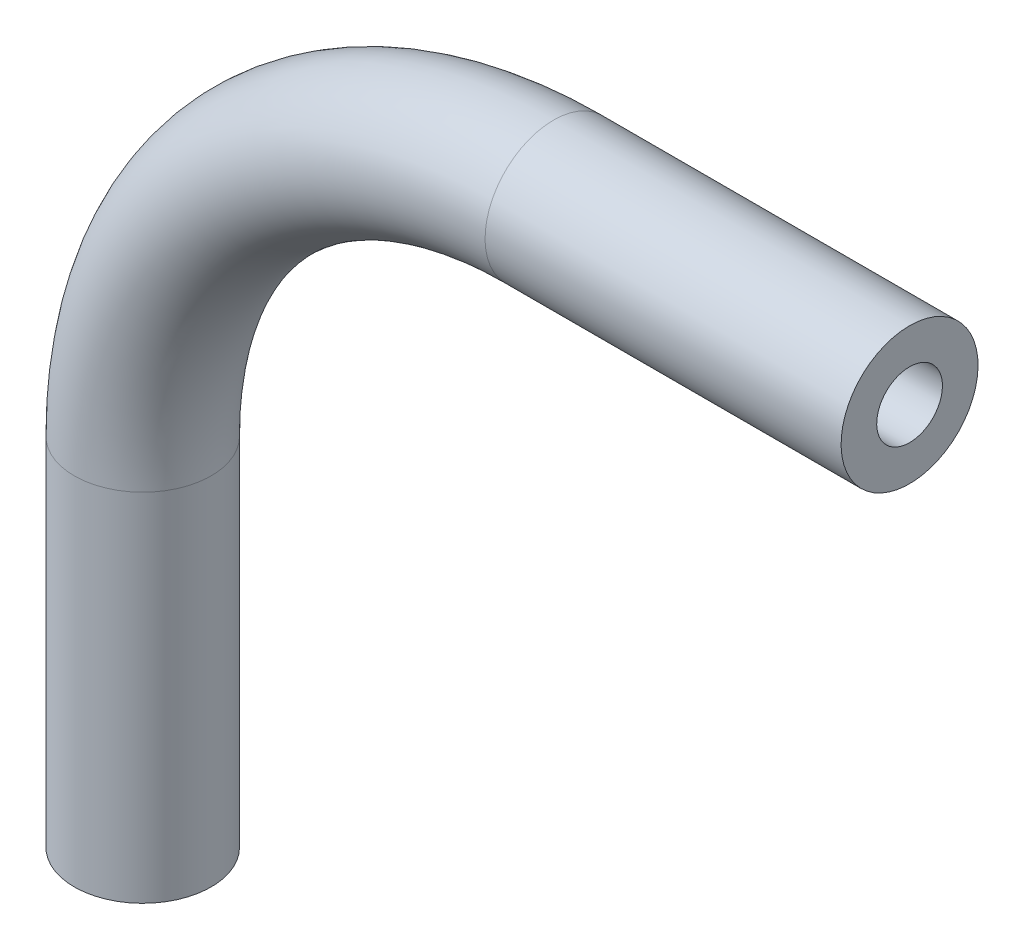
ISO-10303-21;
HEADER;
FILE_DESCRIPTION(('STEP AP214'),'2;1');
FILE_NAME('part.step','',(''),(''),'','','');
FILE_SCHEMA(('AUTOMOTIVE_DESIGN { 1 0 10303 214 1 1 1 1 }'));
ENDSEC;
DATA;
#1=APPLICATION_CONTEXT('core data for automotive mechanical design processes');
#2=APPLICATION_PROTOCOL_DEFINITION('international standard','automotive_design',2000,#1);
#3=PRODUCT_CONTEXT('',#1,'mechanical');
#4=PRODUCT('Part','Part','',(#3));
#5=PRODUCT_RELATED_PRODUCT_CATEGORY('part','',(#4));
#6=PRODUCT_DEFINITION_FORMATION('','',#4);
#7=PRODUCT_DEFINITION_CONTEXT('part definition',#1,'design');
#8=PRODUCT_DEFINITION('design','',#6,#7);
#9=PRODUCT_DEFINITION_SHAPE('','',#8);
#10=(LENGTH_UNIT() NAMED_UNIT(*) SI_UNIT(.MILLI.,.METRE.));
#11=(NAMED_UNIT(*) PLANE_ANGLE_UNIT() SI_UNIT($,.RADIAN.));
#12=(NAMED_UNIT(*) SI_UNIT($,.STERADIAN.) SOLID_ANGLE_UNIT());
#13=UNCERTAINTY_MEASURE_WITH_UNIT(LENGTH_MEASURE(1.E-05),#10,'distance_accuracy_value','');
#14=(GEOMETRIC_REPRESENTATION_CONTEXT(3) GLOBAL_UNCERTAINTY_ASSIGNED_CONTEXT((#13)) GLOBAL_UNIT_ASSIGNED_CONTEXT((#10,
#11,#12)) REPRESENTATION_CONTEXT('',''));
#15=CARTESIAN_POINT('',(0.,0.,0.));
#16=DIRECTION('',(0.,0.,1.));
#17=DIRECTION('',(1.,0.,0.));
#18=AXIS2_PLACEMENT_3D('',#15,#16,#17);
#19=CARTESIAN_POINT('',(0.,-18.0323178807946,0.));
#20=DIRECTION('',(0.,1.,0.));
#21=DIRECTION('',(-1.,0.,0.));
#22=AXIS2_PLACEMENT_3D('',#19,#20,#21);
#23=CYLINDRICAL_SURFACE('',#22,3.175);
#24=CARTESIAN_POINT('',(0.,-1.52231788079484,0.));
#25=DIRECTION('',(0.,1.,0.));
#26=DIRECTION('',(-1.,0.,0.));
#27=AXIS2_PLACEMENT_3D('',#24,#25,#26);
#28=CIRCLE('',#27,3.175);
#29=CARTESIAN_POINT('',(-3.175,-1.52231788079487,0.));
#30=VERTEX_POINT('',#29);
#31=EDGE_CURVE('E84',#30,#30,#28,.T.);
#32=ORIENTED_EDGE('',*,*,#31,.F.);
#33=EDGE_LOOP('',(#32));
#34=FACE_BOUND('',#33,.T.);
#35=CARTESIAN_POINT('',(0.,-18.0323178807946,0.));
#36=DIRECTION('',(0.,1.,0.));
#37=DIRECTION('',(-1.,0.,0.));
#38=AXIS2_PLACEMENT_3D('',#35,#36,#37);
#39=CIRCLE('',#38,3.175);
#40=CARTESIAN_POINT('',(-3.175,-18.0323178807946,0.));
#41=VERTEX_POINT('',#40);
#42=EDGE_CURVE('E53',#41,#41,#39,.T.);
#43=ORIENTED_EDGE('',*,*,#42,.T.);
#44=EDGE_LOOP('',(#43));
#45=FACE_BOUND('',#44,.T.);
#46=ADVANCED_FACE('F38',(#34,#45),#23,.T.);
#47=CARTESIAN_POINT('',(19.05,-1.52231788079469,0.));
#48=DIRECTION('',(0.,0.,-1.));
#49=DIRECTION('',(-1.,0.,0.));
#50=AXIS2_PLACEMENT_3D('',#47,#48,#49);
#51=TOROIDAL_SURFACE('',#50,19.05,3.175);
#52=CARTESIAN_POINT('',(19.0500000000001,17.5276821192053,0.));
#53=DIRECTION('',(1.,0.,0.));
#54=DIRECTION('',(0.,1.,0.));
#55=AXIS2_PLACEMENT_3D('',#52,#53,#54);
#56=CIRCLE('',#55,3.175);
#57=CARTESIAN_POINT('',(19.0500000000001,20.7026821192053,0.));
#58=VERTEX_POINT('',#57);
#59=EDGE_CURVE('E42',#58,#58,#56,.T.);
#60=CARTESIAN_POINT('',(19.05,-1.52231788079469,0.));
#61=DIRECTION('',(0.,0.,-1.));
#62=DIRECTION('',(-1.,0.,0.));
#63=AXIS2_PLACEMENT_3D('',#60,#61,#62);
#64=CIRCLE('',#63,22.225);
#65=EDGE_CURVE('',#30,#58,#64,.T.);
#66=ORIENTED_EDGE('',*,*,#31,.T.);
#67=ORIENTED_EDGE('',*,*,#59,.F.);
#68=ORIENTED_EDGE('',*,*,#65,.T.);
#69=ORIENTED_EDGE('',*,*,#65,.F.);
#70=EDGE_LOOP('',(#66,#68,#67,#69));
#71=FACE_BOUND('',#70,.T.);
#72=ADVANCED_FACE('F92',(#71),#51,.T.);
#73=CARTESIAN_POINT('',(19.0500000000001,17.5276821192053,0.));
#74=DIRECTION('',(1.,0.,0.));
#75=DIRECTION('',(0.,1.,0.));
#76=AXIS2_PLACEMENT_3D('',#73,#74,#75);
#77=CYLINDRICAL_SURFACE('',#76,3.175);
#78=CARTESIAN_POINT('',(35.56,17.5276821192053,0.));
#79=DIRECTION('',(1.,0.,0.));
#80=DIRECTION('',(0.,1.,0.));
#81=AXIS2_PLACEMENT_3D('',#78,#79,#80);
#82=CIRCLE('',#81,3.175);
#83=CARTESIAN_POINT('',(35.56,20.7026821192053,0.));
#84=VERTEX_POINT('',#83);
#85=EDGE_CURVE('E58',#84,#84,#82,.T.);
#86=ORIENTED_EDGE('',*,*,#85,.F.);
#87=EDGE_LOOP('',(#86));
#88=FACE_BOUND('',#87,.T.);
#89=ORIENTED_EDGE('',*,*,#59,.T.);
#90=EDGE_LOOP('',(#89));
#91=FACE_BOUND('',#90,.T.);
#92=ADVANCED_FACE('F40',(#88,#91),#77,.T.);
#93=CARTESIAN_POINT('',(0.,-18.0323178807946,0.));
#94=DIRECTION('',(0.,1.,0.));
#95=DIRECTION('',(-1.,0.,0.));
#96=AXIS2_PLACEMENT_3D('',#93,#94,#95);
#97=PLANE('',#96);
#98=CARTESIAN_POINT('',(0.,-18.0323178807946,0.));
#99=DIRECTION('',(0.,1.,0.));
#100=DIRECTION('',(-1.,0.,0.));
#101=AXIS2_PLACEMENT_3D('',#98,#99,#100);
#102=CIRCLE('',#101,1.524);
#103=CARTESIAN_POINT('',(-1.524,-18.0323178807946,0.));
#104=VERTEX_POINT('',#103);
#105=EDGE_CURVE('E79',#104,#104,#102,.F.);
#106=ORIENTED_EDGE('',*,*,#105,.F.);
#107=EDGE_LOOP('',(#106));
#108=FACE_BOUND('',#107,.T.);
#109=ORIENTED_EDGE('',*,*,#42,.F.);
#110=EDGE_LOOP('',(#109));
#111=FACE_BOUND('',#110,.T.);
#112=ADVANCED_FACE('F98',(#108,#111),#97,.F.);
#113=CARTESIAN_POINT('',(35.56,17.5276821192053,0.));
#114=DIRECTION('',(1.,0.,0.));
#115=DIRECTION('',(0.,1.,0.));
#116=AXIS2_PLACEMENT_3D('',#113,#114,#115);
#117=PLANE('',#116);
#118=CARTESIAN_POINT('',(35.56,17.5276821192053,0.));
#119=DIRECTION('',(1.,0.,0.));
#120=DIRECTION('',(0.,1.,0.));
#121=AXIS2_PLACEMENT_3D('',#118,#119,#120);
#122=CIRCLE('',#121,1.524);
#123=CARTESIAN_POINT('',(35.56,19.0516821192053,0.));
#124=VERTEX_POINT('',#123);
#125=EDGE_CURVE('E11',#124,#124,#122,.F.);
#126=ORIENTED_EDGE('',*,*,#125,.T.);
#127=EDGE_LOOP('',(#126));
#128=FACE_BOUND('',#127,.T.);
#129=ORIENTED_EDGE('',*,*,#85,.T.);
#130=EDGE_LOOP('',(#129));
#131=FACE_BOUND('',#130,.T.);
#132=ADVANCED_FACE('F65',(#128,#131),#117,.T.);
#133=CARTESIAN_POINT('',(0.,-18.0323178807946,0.));
#134=DIRECTION('',(0.,1.,0.));
#135=DIRECTION('',(-1.,0.,0.));
#136=AXIS2_PLACEMENT_3D('',#133,#134,#135);
#137=CYLINDRICAL_SURFACE('',#136,1.524);
#138=CARTESIAN_POINT('',(0.,-1.52231788079484,0.));
#139=DIRECTION('',(0.,1.,0.));
#140=DIRECTION('',(-1.,0.,0.));
#141=AXIS2_PLACEMENT_3D('',#138,#139,#140);
#142=CIRCLE('',#141,1.524);
#143=CARTESIAN_POINT('',(-1.524,-1.52231788079485,0.));
#144=VERTEX_POINT('',#143);
#145=EDGE_CURVE('E76',#144,#144,#142,.F.);
#146=ORIENTED_EDGE('',*,*,#145,.F.);
#147=EDGE_LOOP('',(#146));
#148=FACE_BOUND('',#147,.T.);
#149=ORIENTED_EDGE('',*,*,#105,.T.);
#150=EDGE_LOOP('',(#149));
#151=FACE_BOUND('',#150,.T.);
#152=ADVANCED_FACE('F106',(#148,#151),#137,.F.);
#153=CARTESIAN_POINT('',(19.05,-1.52231788079469,0.));
#154=DIRECTION('',(0.,0.,-1.));
#155=DIRECTION('',(-1.,0.,0.));
#156=AXIS2_PLACEMENT_3D('',#153,#154,#155);
#157=TOROIDAL_SURFACE('',#156,19.05,1.524);
#158=CARTESIAN_POINT('',(19.0500000000001,17.5276821192053,0.));
#159=DIRECTION('',(1.,0.,0.));
#160=DIRECTION('',(0.,1.,0.));
#161=AXIS2_PLACEMENT_3D('',#158,#159,#160);
#162=CIRCLE('',#161,1.524);
#163=CARTESIAN_POINT('',(19.0500000000001,19.0516821192053,0.));
#164=VERTEX_POINT('',#163);
#165=EDGE_CURVE('E47',#164,#164,#162,.F.);
#166=CARTESIAN_POINT('',(19.05,-1.52231788079469,0.));
#167=DIRECTION('',(0.,0.,-1.));
#168=DIRECTION('',(-1.,0.,0.));
#169=AXIS2_PLACEMENT_3D('',#166,#167,#168);
#170=CIRCLE('',#169,20.574);
#171=EDGE_CURVE('',#144,#164,#170,.T.);
#172=ORIENTED_EDGE('',*,*,#145,.T.);
#173=ORIENTED_EDGE('',*,*,#165,.F.);
#174=ORIENTED_EDGE('',*,*,#171,.T.);
#175=ORIENTED_EDGE('',*,*,#171,.F.);
#176=EDGE_LOOP('',(#172,#174,#173,#175));
#177=FACE_BOUND('',#176,.T.);
#178=ADVANCED_FACE('F71',(#177),#157,.F.);
#179=CARTESIAN_POINT('',(19.0500000000001,17.5276821192053,0.));
#180=DIRECTION('',(1.,0.,0.));
#181=DIRECTION('',(0.,1.,0.));
#182=AXIS2_PLACEMENT_3D('',#179,#180,#181);
#183=CYLINDRICAL_SURFACE('',#182,1.524);
#184=ORIENTED_EDGE('',*,*,#125,.F.);
#185=EDGE_LOOP('',(#184));
#186=FACE_BOUND('',#185,.T.);
#187=ORIENTED_EDGE('',*,*,#165,.T.);
#188=EDGE_LOOP('',(#187));
#189=FACE_BOUND('',#188,.T.);
#190=ADVANCED_FACE('F68',(#186,#189),#183,.F.);
#191=CLOSED_SHELL('',(#46,#72,#92,#112,#132,#152,#178,#190));
#192=MANIFOLD_SOLID_BREP('B2',#191);
#193=ADVANCED_BREP_SHAPE_REPRESENTATION('',(#18,#192),#14);
#194=SHAPE_DEFINITION_REPRESENTATION(#9,#193);
ENDSEC;
END-ISO-10303-21;
